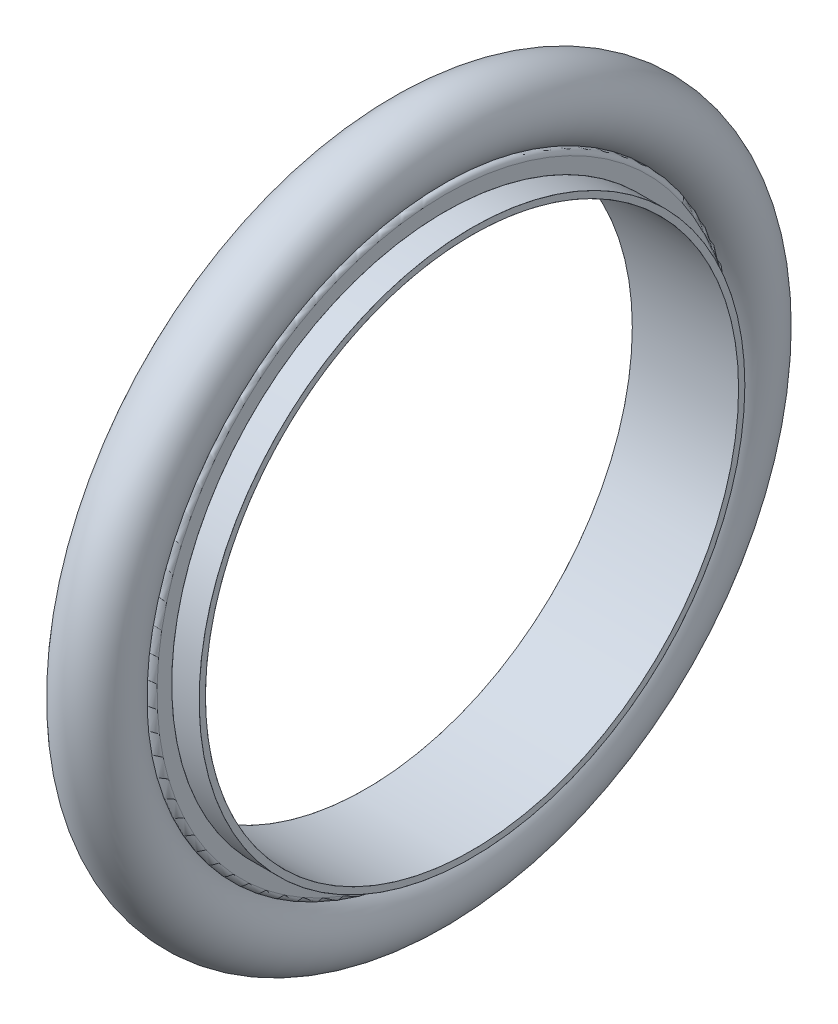
ISO-10303-21;
HEADER;
FILE_DESCRIPTION(('STEP AP214'),'2;1');
FILE_NAME('part.step','',(''),(''),'','','');
FILE_SCHEMA(('AUTOMOTIVE_DESIGN { 1 0 10303 214 1 1 1 1 }'));
ENDSEC;
DATA;
#1=APPLICATION_CONTEXT('core data for automotive mechanical design processes');
#2=APPLICATION_PROTOCOL_DEFINITION('international standard','automotive_design',2000,#1);
#3=PRODUCT_CONTEXT('',#1,'mechanical');
#4=PRODUCT('Part','Part','',(#3));
#5=PRODUCT_RELATED_PRODUCT_CATEGORY('part','',(#4));
#6=PRODUCT_DEFINITION_FORMATION('','',#4);
#7=PRODUCT_DEFINITION_CONTEXT('part definition',#1,'design');
#8=PRODUCT_DEFINITION('design','',#6,#7);
#9=PRODUCT_DEFINITION_SHAPE('','',#8);
#10=(LENGTH_UNIT() NAMED_UNIT(*) SI_UNIT(.MILLI.,.METRE.));
#11=(NAMED_UNIT(*) PLANE_ANGLE_UNIT() SI_UNIT($,.RADIAN.));
#12=(NAMED_UNIT(*) SI_UNIT($,.STERADIAN.) SOLID_ANGLE_UNIT());
#13=UNCERTAINTY_MEASURE_WITH_UNIT(LENGTH_MEASURE(1.E-05),#10,'distance_accuracy_value','');
#14=(GEOMETRIC_REPRESENTATION_CONTEXT(3) GLOBAL_UNCERTAINTY_ASSIGNED_CONTEXT((#13)) GLOBAL_UNIT_ASSIGNED_CONTEXT((#10,
#11,#12)) REPRESENTATION_CONTEXT('',''));
#15=CARTESIAN_POINT('',(0.,0.,0.));
#16=DIRECTION('',(0.,0.,1.));
#17=DIRECTION('',(1.,0.,0.));
#18=AXIS2_PLACEMENT_3D('',#15,#16,#17);
#19=CARTESIAN_POINT('',(-3.16217300000008,0.,0.));
#20=DIRECTION('',(1.,0.,0.));
#21=DIRECTION('',(0.,0.,-1.));
#22=AXIS2_PLACEMENT_3D('',#19,#20,#21);
#23=CYLINDRICAL_SURFACE('',#22,20.0025);
#24=CARTESIAN_POINT('',(-3.98754600000008,0.,0.));
#25=DIRECTION('',(1.,0.,0.));
#26=DIRECTION('',(0.,0.,-1.));
#27=AXIS2_PLACEMENT_3D('',#24,#25,#26);
#28=CIRCLE('',#27,20.0025);
#29=CARTESIAN_POINT('',(-3.98754600000008,0.,-20.0025));
#30=VERTEX_POINT('',#29);
#31=EDGE_CURVE('E238',#30,#30,#28,.T.);
#32=ORIENTED_EDGE('',*,*,#31,.F.);
#33=EDGE_LOOP('',(#32));
#34=FACE_BOUND('',#33,.T.);
#35=CARTESIAN_POINT('',(3.98754599999992,0.,0.));
#36=DIRECTION('',(1.,0.,0.));
#37=DIRECTION('',(0.,0.,-1.));
#38=AXIS2_PLACEMENT_3D('',#35,#36,#37);
#39=CIRCLE('',#38,20.0025);
#40=CARTESIAN_POINT('',(3.98754599999992,0.,-20.0025));
#41=VERTEX_POINT('',#40);
#42=EDGE_CURVE('E234',#41,#41,#39,.F.);
#43=ORIENTED_EDGE('',*,*,#42,.F.);
#44=EDGE_LOOP('',(#43));
#45=FACE_BOUND('',#44,.T.);
#46=ADVANCED_FACE('F14',(#34,#45),#23,.F.);
#47=CARTESIAN_POINT('',(-3.98754600000008,0.,0.));
#48=DIRECTION('',(1.,0.,0.));
#49=DIRECTION('',(0.,0.,-1.));
#50=AXIS2_PLACEMENT_3D('',#47,#48,#49);
#51=TOROIDAL_SURFACE('',#50,20.002754,0.000254);
#52=ORIENTED_EDGE('',*,*,#31,.T.);
#53=EDGE_LOOP('',(#52));
#54=FACE_BOUND('',#53,.T.);
#55=CARTESIAN_POINT('',(-3.98780000000008,0.,0.));
#56=DIRECTION('',(-1.,0.,0.));
#57=DIRECTION('',(0.,1.,0.));
#58=AXIS2_PLACEMENT_3D('',#55,#56,#57);
#59=CIRCLE('',#58,20.002754);
#60=CARTESIAN_POINT('',(-3.98780000000008,20.002754,0.));
#61=VERTEX_POINT('',#60);
#62=EDGE_CURVE('E237',#61,#61,#59,.F.);
#63=ORIENTED_EDGE('',*,*,#62,.F.);
#64=EDGE_LOOP('',(#63));
#65=FACE_BOUND('',#64,.T.);
#66=ADVANCED_FACE('F257',(#54,#65),#51,.T.);
#67=CARTESIAN_POINT('',(3.98754599999992,0.,0.));
#68=DIRECTION('',(1.,0.,0.));
#69=DIRECTION('',(0.,0.,-1.));
#70=AXIS2_PLACEMENT_3D('',#67,#68,#69);
#71=TOROIDAL_SURFACE('',#70,20.002754,0.000254);
#72=CARTESIAN_POINT('',(3.98779999999992,0.,0.));
#73=DIRECTION('',(1.,0.,0.));
#74=DIRECTION('',(0.,1.,0.));
#75=AXIS2_PLACEMENT_3D('',#72,#73,#74);
#76=CIRCLE('',#75,20.002754);
#77=CARTESIAN_POINT('',(3.98779999999992,20.002754,0.));
#78=VERTEX_POINT('',#77);
#79=EDGE_CURVE('E245',#78,#78,#76,.F.);
#80=ORIENTED_EDGE('',*,*,#79,.F.);
#81=EDGE_LOOP('',(#80));
#82=FACE_BOUND('',#81,.T.);
#83=ORIENTED_EDGE('',*,*,#42,.T.);
#84=EDGE_LOOP('',(#83));
#85=FACE_BOUND('',#84,.T.);
#86=ADVANCED_FACE('F209',(#82,#85),#71,.T.);
#87=CARTESIAN_POINT('',(-3.98780000000008,20.23745,0.));
#88=DIRECTION('',(-1.,0.,0.));
#89=DIRECTION('',(0.,0.,1.));
#90=AXIS2_PLACEMENT_3D('',#87,#88,#89);
#91=PLANE('',#90);
#92=ORIENTED_EDGE('',*,*,#62,.T.);
#93=EDGE_LOOP('',(#92));
#94=FACE_BOUND('',#93,.T.);
#95=CARTESIAN_POINT('',(-3.98780000000008,0.,0.));
#96=DIRECTION('',(1.,0.,0.));
#97=DIRECTION('',(0.,1.,0.));
#98=AXIS2_PLACEMENT_3D('',#95,#96,#97);
#99=CIRCLE('',#98,20.472146);
#100=CARTESIAN_POINT('',(-3.98780000000008,20.472146,0.));
#101=VERTEX_POINT('',#100);
#102=EDGE_CURVE('E192',#101,#101,#99,.T.);
#103=ORIENTED_EDGE('',*,*,#102,.F.);
#104=EDGE_LOOP('',(#103));
#105=FACE_BOUND('',#104,.T.);
#106=ADVANCED_FACE('F199',(#94,#105),#91,.T.);
#107=CARTESIAN_POINT('',(3.98779999999992,20.23745,0.));
#108=DIRECTION('',(1.,0.,0.));
#109=DIRECTION('',(0.,0.,-1.));
#110=AXIS2_PLACEMENT_3D('',#107,#108,#109);
#111=PLANE('',#110);
#112=ORIENTED_EDGE('',*,*,#79,.T.);
#113=EDGE_LOOP('',(#112));
#114=FACE_BOUND('',#113,.T.);
#115=CARTESIAN_POINT('',(3.98779999999992,0.,0.));
#116=DIRECTION('',(-1.,0.,0.));
#117=DIRECTION('',(0.,1.,0.));
#118=AXIS2_PLACEMENT_3D('',#115,#116,#117);
#119=CIRCLE('',#118,20.472146);
#120=CARTESIAN_POINT('',(3.98779999999992,20.472146,0.));
#121=VERTEX_POINT('',#120);
#122=EDGE_CURVE('E159',#121,#121,#119,.T.);
#123=ORIENTED_EDGE('',*,*,#122,.F.);
#124=EDGE_LOOP('',(#123));
#125=FACE_BOUND('',#124,.T.);
#126=ADVANCED_FACE('F208',(#114,#125),#111,.T.);
#127=CARTESIAN_POINT('',(-3.98754600000008,0.,0.));
#128=DIRECTION('',(1.,0.,0.));
#129=DIRECTION('',(0.,0.,-1.));
#130=AXIS2_PLACEMENT_3D('',#127,#128,#129);
#131=TOROIDAL_SURFACE('',#130,20.472146,0.000254);
#132=ORIENTED_EDGE('',*,*,#102,.T.);
#133=EDGE_LOOP('',(#132));
#134=FACE_BOUND('',#133,.T.);
#135=CARTESIAN_POINT('',(-3.98754600000008,0.,0.));
#136=DIRECTION('',(1.,0.,0.));
#137=DIRECTION('',(0.,0.,-1.));
#138=AXIS2_PLACEMENT_3D('',#135,#136,#137);
#139=CIRCLE('',#138,20.4724);
#140=CARTESIAN_POINT('',(-3.98754600000008,0.,-20.4724));
#141=VERTEX_POINT('',#140);
#142=EDGE_CURVE('E154',#141,#141,#139,.T.);
#143=ORIENTED_EDGE('',*,*,#142,.F.);
#144=EDGE_LOOP('',(#143));
#145=FACE_BOUND('',#144,.T.);
#146=ADVANCED_FACE('F172',(#134,#145),#131,.T.);
#147=CARTESIAN_POINT('',(3.98754599999992,0.,0.));
#148=DIRECTION('',(1.,0.,0.));
#149=DIRECTION('',(0.,0.,-1.));
#150=AXIS2_PLACEMENT_3D('',#147,#148,#149);
#151=TOROIDAL_SURFACE('',#150,20.472146,0.000254);
#152=CARTESIAN_POINT('',(3.98754599999992,0.,0.));
#153=DIRECTION('',(1.,0.,0.));
#154=DIRECTION('',(0.,0.,-1.));
#155=AXIS2_PLACEMENT_3D('',#152,#153,#154);
#156=CIRCLE('',#155,20.4724);
#157=CARTESIAN_POINT('',(3.98754599999992,0.,-20.4724));
#158=VERTEX_POINT('',#157);
#159=EDGE_CURVE('E146',#158,#158,#156,.F.);
#160=ORIENTED_EDGE('',*,*,#159,.F.);
#161=EDGE_LOOP('',(#160));
#162=FACE_BOUND('',#161,.T.);
#163=ORIENTED_EDGE('',*,*,#122,.T.);
#164=EDGE_LOOP('',(#163));
#165=FACE_BOUND('',#164,.T.);
#166=ADVANCED_FACE('F167',(#162,#165),#151,.T.);
#167=CARTESIAN_POINT('',(-2.95910000000008,0.,0.));
#168=DIRECTION('',(1.,0.,0.));
#169=DIRECTION('',(0.,0.,-1.));
#170=AXIS2_PLACEMENT_3D('',#167,#168,#169);
#171=CYLINDRICAL_SURFACE('',#170,20.4724);
#172=ORIENTED_EDGE('',*,*,#142,.T.);
#173=EDGE_LOOP('',(#172));
#174=FACE_BOUND('',#173,.T.);
#175=CARTESIAN_POINT('',(-1.93065400000008,0.,0.));
#176=DIRECTION('',(1.,0.,0.));
#177=DIRECTION('',(0.,0.,-1.));
#178=AXIS2_PLACEMENT_3D('',#175,#176,#177);
#179=CIRCLE('',#178,20.4724);
#180=CARTESIAN_POINT('',(-1.93065400000008,0.,-20.4724));
#181=VERTEX_POINT('',#180);
#182=EDGE_CURVE('E114',#181,#181,#179,.F.);
#183=ORIENTED_EDGE('',*,*,#182,.T.);
#184=EDGE_LOOP('',(#183));
#185=FACE_BOUND('',#184,.T.);
#186=ADVANCED_FACE('F171',(#174,#185),#171,.T.);
#187=CARTESIAN_POINT('',(2.95909999999992,0.,0.));
#188=DIRECTION('',(1.,0.,0.));
#189=DIRECTION('',(0.,0.,-1.));
#190=AXIS2_PLACEMENT_3D('',#187,#188,#189);
#191=CYLINDRICAL_SURFACE('',#190,20.4724);
#192=CARTESIAN_POINT('',(1.93065399999992,0.,0.));
#193=DIRECTION('',(1.,0.,0.));
#194=DIRECTION('',(0.,0.,-1.));
#195=AXIS2_PLACEMENT_3D('',#192,#193,#194);
#196=CIRCLE('',#195,20.4724);
#197=CARTESIAN_POINT('',(1.93065399999992,0.,-20.4724));
#198=VERTEX_POINT('',#197);
#199=EDGE_CURVE('E110',#198,#198,#196,.T.);
#200=ORIENTED_EDGE('',*,*,#199,.T.);
#201=EDGE_LOOP('',(#200));
#202=FACE_BOUND('',#201,.T.);
#203=ORIENTED_EDGE('',*,*,#159,.T.);
#204=EDGE_LOOP('',(#203));
#205=FACE_BOUND('',#204,.T.);
#206=ADVANCED_FACE('F137',(#202,#205),#191,.T.);
#207=CARTESIAN_POINT('',(-1.93065400000008,0.,0.));
#208=DIRECTION('',(1.,0.,0.));
#209=DIRECTION('',(0.,0.,-1.));
#210=AXIS2_PLACEMENT_3D('',#207,#208,#209);
#211=TOROIDAL_SURFACE('',#210,20.472654,0.000254);
#212=ORIENTED_EDGE('',*,*,#182,.F.);
#213=EDGE_LOOP('',(#212));
#214=FACE_BOUND('',#213,.T.);
#215=CARTESIAN_POINT('',(-1.93040000000008,0.,0.));
#216=DIRECTION('',(-1.,0.,0.));
#217=DIRECTION('',(0.,1.,0.));
#218=AXIS2_PLACEMENT_3D('',#215,#216,#217);
#219=CIRCLE('',#218,20.472654);
#220=CARTESIAN_POINT('',(-1.93040000000008,20.472654,0.));
#221=VERTEX_POINT('',#220);
#222=EDGE_CURVE('E113',#221,#221,#219,.F.);
#223=ORIENTED_EDGE('',*,*,#222,.F.);
#224=EDGE_LOOP('',(#223));
#225=FACE_BOUND('',#224,.T.);
#226=ADVANCED_FACE('F133',(#214,#225),#211,.F.);
#227=CARTESIAN_POINT('',(1.93065399999992,0.,0.));
#228=DIRECTION('',(1.,0.,0.));
#229=DIRECTION('',(0.,0.,-1.));
#230=AXIS2_PLACEMENT_3D('',#227,#228,#229);
#231=TOROIDAL_SURFACE('',#230,20.472654,0.000254);
#232=CARTESIAN_POINT('',(1.93039999999992,0.,0.));
#233=DIRECTION('',(1.,0.,0.));
#234=DIRECTION('',(0.,1.,0.));
#235=AXIS2_PLACEMENT_3D('',#232,#233,#234);
#236=CIRCLE('',#235,20.472654);
#237=CARTESIAN_POINT('',(1.93039999999992,20.472654,0.));
#238=VERTEX_POINT('',#237);
#239=EDGE_CURVE('E121',#238,#238,#236,.F.);
#240=ORIENTED_EDGE('',*,*,#239,.F.);
#241=EDGE_LOOP('',(#240));
#242=FACE_BOUND('',#241,.T.);
#243=ORIENTED_EDGE('',*,*,#199,.F.);
#244=EDGE_LOOP('',(#243));
#245=FACE_BOUND('',#244,.T.);
#246=ADVANCED_FACE('F84',(#242,#245),#231,.F.);
#247=CARTESIAN_POINT('',(-1.93040000000008,21.0234406098197,0.));
#248=DIRECTION('',(-1.,0.,0.));
#249=DIRECTION('',(0.,0.,1.));
#250=AXIS2_PLACEMENT_3D('',#247,#248,#249);
#251=PLANE('',#250);
#252=ORIENTED_EDGE('',*,*,#222,.T.);
#253=EDGE_LOOP('',(#252));
#254=FACE_BOUND('',#253,.T.);
#255=CARTESIAN_POINT('',(-1.93040000000008,0.,0.));
#256=DIRECTION('',(1.,0.,0.));
#257=DIRECTION('',(0.,1.,0.));
#258=AXIS2_PLACEMENT_3D('',#255,#256,#257);
#259=CIRCLE('',#258,21.5742272196394);
#260=CARTESIAN_POINT('',(-1.93040000000008,21.5742272196394,0.));
#261=VERTEX_POINT('',#260);
#262=EDGE_CURVE('E67',#261,#261,#259,.T.);
#263=ORIENTED_EDGE('',*,*,#262,.F.);
#264=EDGE_LOOP('',(#263));
#265=FACE_BOUND('',#264,.T.);
#266=ADVANCED_FACE('F74',(#254,#265),#251,.T.);
#267=CARTESIAN_POINT('',(1.93039999999992,21.0234406098196,0.));
#268=DIRECTION('',(1.,0.,0.));
#269=DIRECTION('',(0.,0.,-1.));
#270=AXIS2_PLACEMENT_3D('',#267,#268,#269);
#271=PLANE('',#270);
#272=ORIENTED_EDGE('',*,*,#239,.T.);
#273=EDGE_LOOP('',(#272));
#274=FACE_BOUND('',#273,.T.);
#275=CARTESIAN_POINT('',(1.93039999999992,0.,0.));
#276=DIRECTION('',(-1.,0.,0.));
#277=DIRECTION('',(0.,1.,0.));
#278=AXIS2_PLACEMENT_3D('',#275,#276,#277);
#279=CIRCLE('',#278,21.5742272196393);
#280=CARTESIAN_POINT('',(1.93039999999992,21.5742272196393,0.));
#281=VERTEX_POINT('',#280);
#282=EDGE_CURVE('E27',#281,#281,#279,.T.);
#283=ORIENTED_EDGE('',*,*,#282,.F.);
#284=EDGE_LOOP('',(#283));
#285=FACE_BOUND('',#284,.T.);
#286=ADVANCED_FACE('F83',(#274,#285),#271,.T.);
#287=CARTESIAN_POINT('',(-1.54940000000008,0.,0.));
#288=DIRECTION('',(1.,0.,0.));
#289=DIRECTION('',(0.,0.,-1.));
#290=AXIS2_PLACEMENT_3D('',#287,#288,#289);
#291=TOROIDAL_SURFACE('',#290,21.5742272196394,0.381);
#292=CARTESIAN_POINT('',(-1.47879421139551,0.,0.));
#293=DIRECTION('',(1.,0.,0.));
#294=DIRECTION('',(0.,0.,-1.));
#295=AXIS2_PLACEMENT_3D('',#292,#293,#294);
#296=CIRCLE('',#295,21.948627837448);
#297=CARTESIAN_POINT('',(-1.47879421139551,0.,-21.948627837448));
#298=VERTEX_POINT('',#297);
#299=EDGE_CURVE('E22',#298,#298,#296,.T.);
#300=ORIENTED_EDGE('',*,*,#299,.F.);
#301=EDGE_LOOP('',(#300));
#302=FACE_BOUND('',#301,.T.);
#303=ORIENTED_EDGE('',*,*,#262,.T.);
#304=EDGE_LOOP('',(#303));
#305=FACE_BOUND('',#304,.T.);
#306=ADVANCED_FACE('F47',(#302,#305),#291,.T.);
#307=CARTESIAN_POINT('',(1.54939999999992,0.,0.));
#308=DIRECTION('',(1.,0.,0.));
#309=DIRECTION('',(0.,0.,-1.));
#310=AXIS2_PLACEMENT_3D('',#307,#308,#309);
#311=TOROIDAL_SURFACE('',#310,21.5742272196393,0.381);
#312=ORIENTED_EDGE('',*,*,#282,.T.);
#313=EDGE_LOOP('',(#312));
#314=FACE_BOUND('',#313,.T.);
#315=CARTESIAN_POINT('',(1.47879421139535,0.,0.));
#316=DIRECTION('',(1.,0.,0.));
#317=DIRECTION('',(0.,0.,-1.));
#318=AXIS2_PLACEMENT_3D('',#315,#316,#317);
#319=CIRCLE('',#318,21.9486278374479);
#320=CARTESIAN_POINT('',(1.47879421139535,0.,-21.9486278374479));
#321=VERTEX_POINT('',#320);
#322=EDGE_CURVE('E10',#321,#321,#319,.F.);
#323=ORIENTED_EDGE('',*,*,#322,.F.);
#324=EDGE_LOOP('',(#323));
#325=FACE_BOUND('',#324,.T.);
#326=ADVANCED_FACE('F41',(#314,#325),#311,.T.);
#327=CARTESIAN_POINT('',(0.,0.,0.));
#328=DIRECTION('',(1.,0.,0.));
#329=DIRECTION('',(0.,0.,-1.));
#330=AXIS2_PLACEMENT_3D('',#327,#328,#329);
#331=TOROIDAL_SURFACE('',#330,24.1681,2.667);
#332=ORIENTED_EDGE('',*,*,#322,.T.);
#333=EDGE_LOOP('',(#332));
#334=FACE_BOUND('',#333,.T.);
#335=ORIENTED_EDGE('',*,*,#299,.T.);
#336=EDGE_LOOP('',(#335));
#337=FACE_BOUND('',#336,.T.);
#338=ADVANCED_FACE('F46',(#334,#337),#331,.T.);
#339=CLOSED_SHELL('',(#46,#66,#86,#106,#126,#146,#166,#186,#206,#226,#246,#266,#286,#306,#326,#338));
#340=MANIFOLD_SOLID_BREP('B1',#339);
#341=ADVANCED_BREP_SHAPE_REPRESENTATION('',(#18,#340),#14);
#342=SHAPE_DEFINITION_REPRESENTATION(#9,#341);
ENDSEC;
END-ISO-10303-21;
